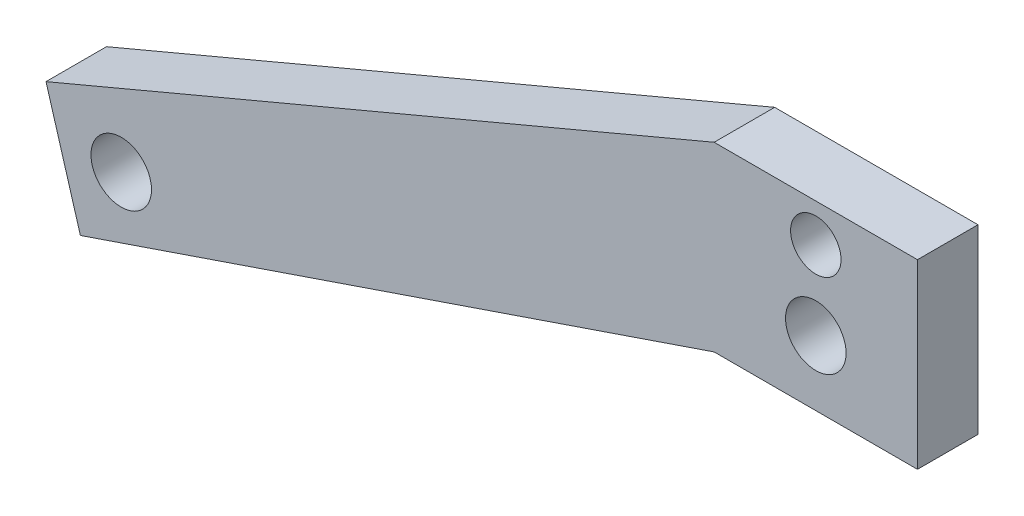
ISO-10303-21;
HEADER;
FILE_DESCRIPTION(('STEP AP214'),'2;1');
FILE_NAME('part.step','',(''),(''),'','','');
FILE_SCHEMA(('AUTOMOTIVE_DESIGN { 1 0 10303 214 1 1 1 1 }'));
ENDSEC;
DATA;
#1=APPLICATION_CONTEXT('core data for automotive mechanical design processes');
#2=APPLICATION_PROTOCOL_DEFINITION('international standard','automotive_design',2000,#1);
#3=PRODUCT_CONTEXT('',#1,'mechanical');
#4=PRODUCT('Part','Part','',(#3));
#5=PRODUCT_RELATED_PRODUCT_CATEGORY('part','',(#4));
#6=PRODUCT_DEFINITION_FORMATION('','',#4);
#7=PRODUCT_DEFINITION_CONTEXT('part definition',#1,'design');
#8=PRODUCT_DEFINITION('design','',#6,#7);
#9=PRODUCT_DEFINITION_SHAPE('','',#8);
#10=(LENGTH_UNIT() NAMED_UNIT(*) SI_UNIT(.MILLI.,.METRE.));
#11=(NAMED_UNIT(*) PLANE_ANGLE_UNIT() SI_UNIT($,.RADIAN.));
#12=(NAMED_UNIT(*) SI_UNIT($,.STERADIAN.) SOLID_ANGLE_UNIT());
#13=UNCERTAINTY_MEASURE_WITH_UNIT(LENGTH_MEASURE(1.E-05),#10,'distance_accuracy_value','');
#14=(GEOMETRIC_REPRESENTATION_CONTEXT(3) GLOBAL_UNCERTAINTY_ASSIGNED_CONTEXT((#13)) GLOBAL_UNIT_ASSIGNED_CONTEXT((#10,
#11,#12)) REPRESENTATION_CONTEXT('',''));
#15=CARTESIAN_POINT('',(0.,0.,0.));
#16=DIRECTION('',(0.,0.,1.));
#17=DIRECTION('',(1.,0.,0.));
#18=AXIS2_PLACEMENT_3D('',#15,#16,#17);
#19=CARTESIAN_POINT('',(-111.181731184165,-32.9335291699961,9.525));
#20=DIRECTION('',(-0.958819734868193,-0.284015344703924,0.));
#21=DIRECTION('',(0.284015344703924,-0.958819734868193,0.));
#22=AXIS2_PLACEMENT_3D('',#19,#20,#21);
#23=PLANE('',#22);
#24=DIRECTION('',(-0.284015344703924,0.958819734868193,0.));
#25=VECTOR('',#24,1.);
#26=CARTESIAN_POINT('',(-111.181731184165,-32.9335291699961,0.));
#27=LINE('',#26,#25);
#28=CARTESIAN_POINT('',(-115.733139183861,-17.5682332698922,0.));
#29=VERTEX_POINT('',#28);
#30=CARTESIAN_POINT('',(-121.143631500471,0.697282679346885,0.));
#31=VERTEX_POINT('',#30);
#32=EDGE_CURVE('E130',#29,#31,#27,.T.);
#33=ORIENTED_EDGE('',*,*,#32,.F.);
#34=DIRECTION('',(0.,0.,-1.));
#35=VECTOR('',#34,1.);
#36=CARTESIAN_POINT('',(-115.733139183861,-17.5682332698922,9.525));
#37=LINE('',#36,#35);
#38=CARTESIAN_POINT('',(-115.733139183861,-17.5682332698922,9.525));
#39=VERTEX_POINT('',#38);
#40=EDGE_CURVE('E11',#39,#29,#37,.T.);
#41=ORIENTED_EDGE('',*,*,#40,.F.);
#42=DIRECTION('',(-0.284015344703924,0.958819734868193,0.));
#43=VECTOR('',#42,1.);
#44=CARTESIAN_POINT('',(-111.181731184165,-32.9335291699961,9.525));
#45=LINE('',#44,#43);
#46=CARTESIAN_POINT('',(-121.143631500471,0.697282679346885,9.525));
#47=VERTEX_POINT('',#46);
#48=EDGE_CURVE('E254',#39,#47,#45,.T.);
#49=ORIENTED_EDGE('',*,*,#48,.T.);
#50=DIRECTION('',(0.,0.,-1.));
#51=VECTOR('',#50,1.);
#52=CARTESIAN_POINT('',(-121.143631500471,0.697282679346885,9.525));
#53=LINE('',#52,#51);
#54=EDGE_CURVE('E80',#47,#31,#53,.T.);
#55=ORIENTED_EDGE('',*,*,#54,.T.);
#56=EDGE_LOOP('',(#33,#41,#49,#55));
#57=FACE_BOUND('',#56,.T.);
#58=ADVANCED_FACE('F35',(#57),#23,.T.);
#59=CARTESIAN_POINT('',(-6.68093946845817,19.6012995194307,9.525));
#60=DIRECTION('',(0.322616747331422,-0.946529679588175,0.));
#61=DIRECTION('',(0.946529679588175,0.322616747331422,0.));
#62=AXIS2_PLACEMENT_3D('',#59,#60,#61);
#63=PLANE('',#62);
#64=DIRECTION('',(-0.946529679588175,-0.322616747331422,0.));
#65=VECTOR('',#64,1.);
#66=CARTESIAN_POINT('',(-6.68093946845817,19.6012995194307,0.));
#67=LINE('',#66,#65);
#68=CARTESIAN_POINT('',(-15.9999937728734,16.4249775796861,0.));
#69=VERTEX_POINT('',#68);
#70=EDGE_CURVE('E128',#69,#29,#67,.T.);
#71=ORIENTED_EDGE('',*,*,#70,.F.);
#72=DIRECTION('',(0.,0.,-1.));
#73=VECTOR('',#72,1.);
#74=CARTESIAN_POINT('',(-15.9999937728734,16.4249775796861,9.525));
#75=LINE('',#74,#73);
#76=CARTESIAN_POINT('',(-15.9999937728734,16.4249775796861,9.525));
#77=VERTEX_POINT('',#76);
#78=EDGE_CURVE('E44',#77,#69,#75,.T.);
#79=ORIENTED_EDGE('',*,*,#78,.F.);
#80=DIRECTION('',(-0.946529679588175,-0.322616747331422,0.));
#81=VECTOR('',#80,1.);
#82=CARTESIAN_POINT('',(-6.68093946845817,19.6012995194307,9.525));
#83=LINE('',#82,#81);
#84=EDGE_CURVE('E255',#77,#39,#83,.T.);
#85=ORIENTED_EDGE('',*,*,#84,.T.);
#86=ORIENTED_EDGE('',*,*,#40,.T.);
#87=EDGE_LOOP('',(#71,#79,#85,#86));
#88=FACE_BOUND('',#87,.T.);
#89=ADVANCED_FACE('F129',(#88),#63,.T.);
#90=CARTESIAN_POINT('',(0.,16.4249775796861,9.525));
#91=DIRECTION('',(0.,-1.,0.));
#92=DIRECTION('',(1.,0.,0.));
#93=AXIS2_PLACEMENT_3D('',#90,#91,#92);
#94=PLANE('',#93);
#95=DIRECTION('',(-1.,0.,0.));
#96=VECTOR('',#95,1.);
#97=CARTESIAN_POINT('',(0.,16.4249775796861,0.));
#98=LINE('',#97,#96);
#99=CARTESIAN_POINT('',(16.0000062271267,16.4249775796861,0.));
#100=VERTEX_POINT('',#99);
#101=EDGE_CURVE('E124',#100,#69,#98,.T.);
#102=ORIENTED_EDGE('',*,*,#101,.F.);
#103=DIRECTION('',(0.,0.,-1.));
#104=VECTOR('',#103,1.);
#105=CARTESIAN_POINT('',(16.0000062271267,16.4249775796861,9.525));
#106=LINE('',#105,#104);
#107=CARTESIAN_POINT('',(16.0000062271267,16.4249775796861,9.525));
#108=VERTEX_POINT('',#107);
#109=EDGE_CURVE('E114',#108,#100,#106,.T.);
#110=ORIENTED_EDGE('',*,*,#109,.F.);
#111=DIRECTION('',(-1.,0.,0.));
#112=VECTOR('',#111,1.);
#113=CARTESIAN_POINT('',(0.,16.4249775796861,9.525));
#114=LINE('',#113,#112);
#115=EDGE_CURVE('E108',#108,#77,#114,.T.);
#116=ORIENTED_EDGE('',*,*,#115,.T.);
#117=ORIENTED_EDGE('',*,*,#78,.T.);
#118=EDGE_LOOP('',(#102,#110,#116,#117));
#119=FACE_BOUND('',#118,.T.);
#120=ADVANCED_FACE('F122',(#119),#94,.T.);
#121=CARTESIAN_POINT('',(16.0000062271267,0.,9.525));
#122=DIRECTION('',(-1.,0.,0.));
#123=DIRECTION('',(0.,-1.,0.));
#124=AXIS2_PLACEMENT_3D('',#121,#122,#123);
#125=PLANE('',#124);
#126=DIRECTION('',(0.,1.,0.));
#127=VECTOR('',#126,1.);
#128=CARTESIAN_POINT('',(16.0000062271267,0.,0.));
#129=LINE('',#128,#127);
#130=CARTESIAN_POINT('',(16.0000062271267,44.9999775796863,0.));
#131=VERTEX_POINT('',#130);
#132=EDGE_CURVE('E113',#100,#131,#129,.T.);
#133=ORIENTED_EDGE('',*,*,#132,.T.);
#134=DIRECTION('',(0.,0.,-1.));
#135=VECTOR('',#134,1.);
#136=CARTESIAN_POINT('',(16.0000062271267,44.9999775796863,9.525));
#137=LINE('',#136,#135);
#138=CARTESIAN_POINT('',(16.0000062271267,44.9999775796863,9.525));
#139=VERTEX_POINT('',#138);
#140=EDGE_CURVE('E98',#139,#131,#137,.T.);
#141=ORIENTED_EDGE('',*,*,#140,.F.);
#142=DIRECTION('',(0.,1.,0.));
#143=VECTOR('',#142,1.);
#144=CARTESIAN_POINT('',(16.0000062271267,0.,9.525));
#145=LINE('',#144,#143);
#146=EDGE_CURVE('E101',#108,#139,#145,.T.);
#147=ORIENTED_EDGE('',*,*,#146,.F.);
#148=ORIENTED_EDGE('',*,*,#109,.T.);
#149=EDGE_LOOP('',(#133,#141,#147,#148));
#150=FACE_BOUND('',#149,.T.);
#151=ADVANCED_FACE('F111',(#150),#125,.F.);
#152=CARTESIAN_POINT('',(0.,44.9999775796863,9.525));
#153=DIRECTION('',(0.,-1.,0.));
#154=DIRECTION('',(0.,0.,-1.));
#155=AXIS2_PLACEMENT_3D('',#152,#153,#154);
#156=PLANE('',#155);
#157=DIRECTION('',(-1.,0.,0.));
#158=VECTOR('',#157,1.);
#159=CARTESIAN_POINT('',(0.,44.9999775796863,0.));
#160=LINE('',#159,#158);
#161=CARTESIAN_POINT('',(-15.9999937728733,44.9999775796863,0.));
#162=VERTEX_POINT('',#161);
#163=EDGE_CURVE('E134',#131,#162,#160,.T.);
#164=ORIENTED_EDGE('',*,*,#163,.T.);
#165=DIRECTION('',(0.,0.,-1.));
#166=VECTOR('',#165,1.);
#167=CARTESIAN_POINT('',(-15.9999937728733,44.9999775796863,9.525));
#168=LINE('',#167,#166);
#169=CARTESIAN_POINT('',(-15.9999937728733,44.9999775796863,9.525));
#170=VERTEX_POINT('',#169);
#171=EDGE_CURVE('E100',#170,#162,#168,.T.);
#172=ORIENTED_EDGE('',*,*,#171,.F.);
#173=DIRECTION('',(-1.,0.,0.));
#174=VECTOR('',#173,1.);
#175=CARTESIAN_POINT('',(0.,44.9999775796863,9.525));
#176=LINE('',#175,#174);
#177=EDGE_CURVE('E93',#139,#170,#176,.T.);
#178=ORIENTED_EDGE('',*,*,#177,.F.);
#179=ORIENTED_EDGE('',*,*,#140,.T.);
#180=EDGE_LOOP('',(#164,#172,#178,#179));
#181=FACE_BOUND('',#180,.T.);
#182=ADVANCED_FACE('F96',(#181),#156,.F.);
#183=CARTESIAN_POINT('',(6.22712671610374E-06,38.9999775796863,9.525));
#184=DIRECTION('',(0.,0.,-1.));
#185=DIRECTION('',(-1.,0.,0.));
#186=AXIS2_PLACEMENT_3D('',#183,#184,#185);
#187=CYLINDRICAL_SURFACE('',#186,3.96875);
#188=CARTESIAN_POINT('',(6.22712671610374E-06,38.9999775796863,9.525));
#189=DIRECTION('',(0.,0.,1.));
#190=DIRECTION('',(1.,0.,0.));
#191=AXIS2_PLACEMENT_3D('',#188,#189,#190);
#192=CIRCLE('',#191,3.96875);
#193=CARTESIAN_POINT('',(3.96875622712672,38.9999775796863,9.525));
#194=VERTEX_POINT('',#193);
#195=EDGE_CURVE('E256',#194,#194,#192,.T.);
#196=ORIENTED_EDGE('',*,*,#195,.T.);
#197=EDGE_LOOP('',(#196));
#198=FACE_BOUND('',#197,.T.);
#199=CARTESIAN_POINT('',(6.22712671610374E-06,38.9999775796863,0.));
#200=DIRECTION('',(0.,0.,1.));
#201=DIRECTION('',(1.,0.,0.));
#202=AXIS2_PLACEMENT_3D('',#199,#200,#201);
#203=CIRCLE('',#202,3.96875);
#204=CARTESIAN_POINT('',(3.96875622712672,38.9999775796863,0.));
#205=VERTEX_POINT('',#204);
#206=EDGE_CURVE('E148',#205,#205,#203,.T.);
#207=ORIENTED_EDGE('',*,*,#206,.F.);
#208=EDGE_LOOP('',(#207));
#209=FACE_BOUND('',#208,.T.);
#210=ADVANCED_FACE('F158',(#198,#209),#187,.F.);
#211=CARTESIAN_POINT('',(6.23902837032508E-06,26.6475746126805,9.525));
#212=DIRECTION('',(0.,0.,-1.));
#213=DIRECTION('',(-1.,0.,0.));
#214=AXIS2_PLACEMENT_3D('',#211,#212,#213);
#215=CYLINDRICAL_SURFACE('',#214,4.76250000164186);
#216=CARTESIAN_POINT('',(6.23902837032508E-06,26.6475746126805,9.525));
#217=DIRECTION('',(0.,0.,1.));
#218=DIRECTION('',(1.,0.,0.));
#219=AXIS2_PLACEMENT_3D('',#216,#217,#218);
#220=CIRCLE('',#219,4.76250000164186);
#221=CARTESIAN_POINT('',(4.76250624067023,26.6475746126805,9.525));
#222=VERTEX_POINT('',#221);
#223=EDGE_CURVE('E172',#222,#222,#220,.T.);
#224=ORIENTED_EDGE('',*,*,#223,.T.);
#225=EDGE_LOOP('',(#224));
#226=FACE_BOUND('',#225,.T.);
#227=CARTESIAN_POINT('',(6.23902837032508E-06,26.6475746126805,0.));
#228=DIRECTION('',(0.,0.,1.));
#229=DIRECTION('',(1.,0.,0.));
#230=AXIS2_PLACEMENT_3D('',#227,#228,#229);
#231=CIRCLE('',#230,4.76250000164186);
#232=CARTESIAN_POINT('',(4.76250624067023,26.6475746126805,0.));
#233=VERTEX_POINT('',#232);
#234=EDGE_CURVE('E145',#233,#233,#231,.T.);
#235=ORIENTED_EDGE('',*,*,#234,.F.);
#236=EDGE_LOOP('',(#235));
#237=FACE_BOUND('',#236,.T.);
#238=ADVANCED_FACE('F160',(#226,#237),#215,.F.);
#239=CARTESIAN_POINT('',(-109.305627367547,-5.73022913696779,9.525));
#240=DIRECTION('',(0.,0.,-1.));
#241=DIRECTION('',(-1.,0.,0.));
#242=AXIS2_PLACEMENT_3D('',#239,#240,#241);
#243=CYLINDRICAL_SURFACE('',#242,4.76250000164186);
#244=CARTESIAN_POINT('',(-109.305627367547,-5.73022913696779,9.525));
#245=DIRECTION('',(0.,0.,1.));
#246=DIRECTION('',(1.,0.,0.));
#247=AXIS2_PLACEMENT_3D('',#244,#245,#246);
#248=CIRCLE('',#247,4.76250000164186);
#249=CARTESIAN_POINT('',(-104.543127365905,-5.73022913696779,9.525));
#250=VERTEX_POINT('',#249);
#251=EDGE_CURVE('E139',#250,#250,#248,.T.);
#252=ORIENTED_EDGE('',*,*,#251,.T.);
#253=EDGE_LOOP('',(#252));
#254=FACE_BOUND('',#253,.T.);
#255=CARTESIAN_POINT('',(-109.305627367547,-5.73022913696779,0.));
#256=DIRECTION('',(0.,0.,1.));
#257=DIRECTION('',(1.,0.,0.));
#258=AXIS2_PLACEMENT_3D('',#255,#256,#257);
#259=CIRCLE('',#258,4.76250000164186);
#260=CARTESIAN_POINT('',(-104.543127365905,-5.73022913696779,0.));
#261=VERTEX_POINT('',#260);
#262=EDGE_CURVE('E142',#261,#261,#259,.T.);
#263=ORIENTED_EDGE('',*,*,#262,.F.);
#264=EDGE_LOOP('',(#263));
#265=FACE_BOUND('',#264,.T.);
#266=ADVANCED_FACE('F37',(#254,#265),#243,.F.);
#267=CARTESIAN_POINT('',(-18.5144984661136,43.9404809077269,9.525));
#268=DIRECTION('',(0.388292906680553,-0.921536010485519,0.));
#269=DIRECTION('',(0.921536010485519,0.388292906680553,0.));
#270=AXIS2_PLACEMENT_3D('',#267,#268,#269);
#271=PLANE('',#270);
#272=DIRECTION('',(-0.921536010485519,-0.388292906680553,0.));
#273=VECTOR('',#272,1.);
#274=CARTESIAN_POINT('',(-18.5144984661136,43.9404809077269,0.));
#275=LINE('',#274,#273);
#276=EDGE_CURVE('E73',#162,#31,#275,.T.);
#277=ORIENTED_EDGE('',*,*,#276,.T.);
#278=ORIENTED_EDGE('',*,*,#54,.F.);
#279=DIRECTION('',(-0.921536010485519,-0.388292906680553,0.));
#280=VECTOR('',#279,1.);
#281=CARTESIAN_POINT('',(-18.5144984661136,43.9404809077269,9.525));
#282=LINE('',#281,#280);
#283=EDGE_CURVE('E52',#170,#47,#282,.T.);
#284=ORIENTED_EDGE('',*,*,#283,.F.);
#285=ORIENTED_EDGE('',*,*,#171,.T.);
#286=EDGE_LOOP('',(#277,#278,#284,#285));
#287=FACE_BOUND('',#286,.T.);
#288=ADVANCED_FACE('F167',(#287),#271,.F.);
#289=CARTESIAN_POINT('',(0.,0.,9.525));
#290=DIRECTION('',(0.,0.,1.));
#291=DIRECTION('',(1.,0.,0.));
#292=AXIS2_PLACEMENT_3D('',#289,#290,#291);
#293=PLANE('',#292);
#294=ORIENTED_EDGE('',*,*,#251,.F.);
#295=EDGE_LOOP('',(#294));
#296=FACE_BOUND('',#295,.T.);
#297=ORIENTED_EDGE('',*,*,#223,.F.);
#298=EDGE_LOOP('',(#297));
#299=FACE_BOUND('',#298,.T.);
#300=ORIENTED_EDGE('',*,*,#195,.F.);
#301=EDGE_LOOP('',(#300));
#302=FACE_BOUND('',#301,.T.);
#303=ORIENTED_EDGE('',*,*,#48,.F.);
#304=ORIENTED_EDGE('',*,*,#84,.F.);
#305=ORIENTED_EDGE('',*,*,#115,.F.);
#306=ORIENTED_EDGE('',*,*,#146,.T.);
#307=ORIENTED_EDGE('',*,*,#177,.T.);
#308=ORIENTED_EDGE('',*,*,#283,.T.);
#309=EDGE_LOOP('',(#303,#304,#305,#306,#307,#308));
#310=FACE_BOUND('',#309,.T.);
#311=ADVANCED_FACE('F105',(#296,#299,#302,#310),#293,.T.);
#312=CARTESIAN_POINT('',(0.,0.,0.));
#313=DIRECTION('',(0.,0.,1.));
#314=DIRECTION('',(1.,0.,0.));
#315=AXIS2_PLACEMENT_3D('',#312,#313,#314);
#316=PLANE('',#315);
#317=ORIENTED_EDGE('',*,*,#262,.T.);
#318=EDGE_LOOP('',(#317));
#319=FACE_BOUND('',#318,.T.);
#320=ORIENTED_EDGE('',*,*,#234,.T.);
#321=EDGE_LOOP('',(#320));
#322=FACE_BOUND('',#321,.T.);
#323=ORIENTED_EDGE('',*,*,#206,.T.);
#324=EDGE_LOOP('',(#323));
#325=FACE_BOUND('',#324,.T.);
#326=ORIENTED_EDGE('',*,*,#32,.T.);
#327=ORIENTED_EDGE('',*,*,#276,.F.);
#328=ORIENTED_EDGE('',*,*,#163,.F.);
#329=ORIENTED_EDGE('',*,*,#132,.F.);
#330=ORIENTED_EDGE('',*,*,#101,.T.);
#331=ORIENTED_EDGE('',*,*,#70,.T.);
#332=EDGE_LOOP('',(#326,#327,#328,#329,#330,#331));
#333=FACE_BOUND('',#332,.T.);
#334=ADVANCED_FACE('F132',(#319,#322,#325,#333),#316,.F.);
#335=CLOSED_SHELL('',(#58,#89,#120,#151,#182,#210,#238,#266,#288,#311,#334));
#336=MANIFOLD_SOLID_BREP('B2',#335);
#337=ADVANCED_BREP_SHAPE_REPRESENTATION('',(#18,#336),#14);
#338=SHAPE_DEFINITION_REPRESENTATION(#9,#337);
ENDSEC;
END-ISO-10303-21;
